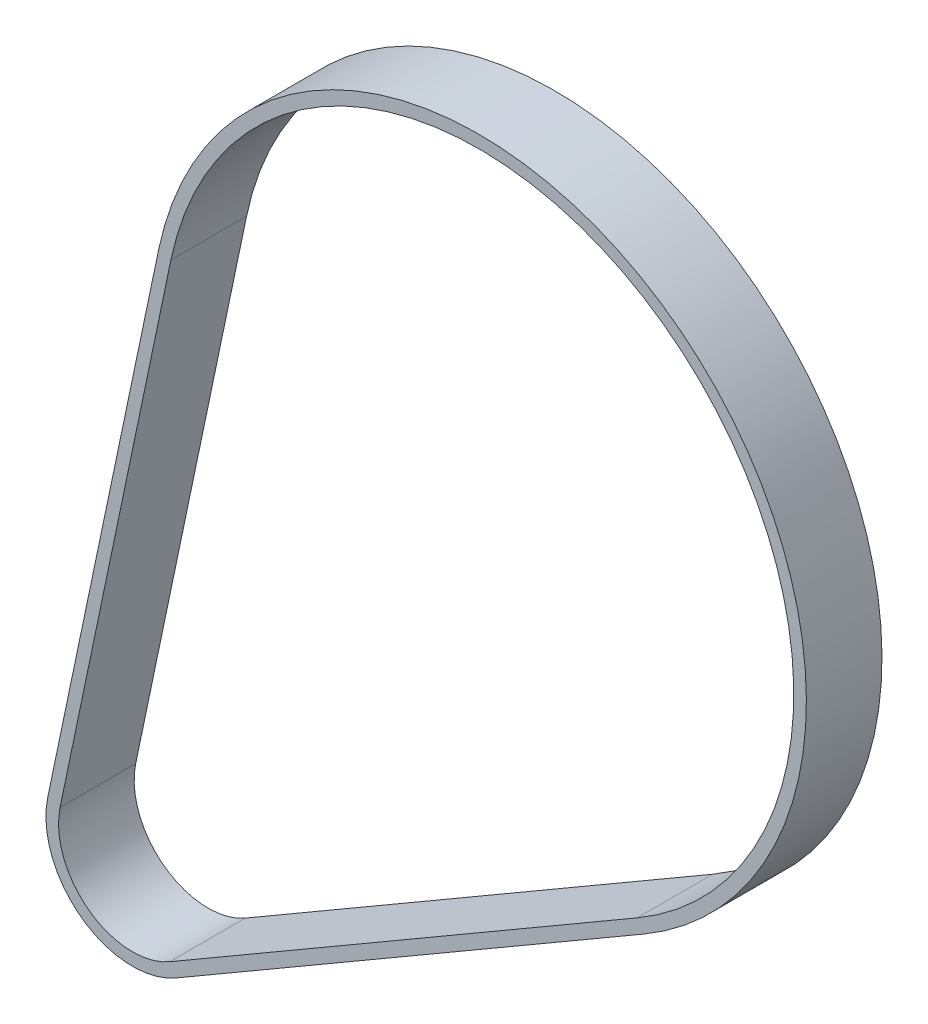
ISO-10303-21;
HEADER;
FILE_DESCRIPTION(('STEP AP214'),'2;1');
FILE_NAME('part.step','',(''),(''),'','','');
FILE_SCHEMA(('AUTOMOTIVE_DESIGN { 1 0 10303 214 1 1 1 1 }'));
ENDSEC;
DATA;
#1=APPLICATION_CONTEXT('core data for automotive mechanical design processes');
#2=APPLICATION_PROTOCOL_DEFINITION('international standard','automotive_design',2000,#1);
#3=PRODUCT_CONTEXT('',#1,'mechanical');
#4=PRODUCT('Part','Part','',(#3));
#5=PRODUCT_RELATED_PRODUCT_CATEGORY('part','',(#4));
#6=PRODUCT_DEFINITION_FORMATION('','',#4);
#7=PRODUCT_DEFINITION_CONTEXT('part definition',#1,'design');
#8=PRODUCT_DEFINITION('design','',#6,#7);
#9=PRODUCT_DEFINITION_SHAPE('','',#8);
#10=(LENGTH_UNIT() NAMED_UNIT(*) SI_UNIT(.MILLI.,.METRE.));
#11=(NAMED_UNIT(*) PLANE_ANGLE_UNIT() SI_UNIT($,.RADIAN.));
#12=(NAMED_UNIT(*) SI_UNIT($,.STERADIAN.) SOLID_ANGLE_UNIT());
#13=UNCERTAINTY_MEASURE_WITH_UNIT(LENGTH_MEASURE(1.E-05),#10,'distance_accuracy_value','');
#14=(GEOMETRIC_REPRESENTATION_CONTEXT(3) GLOBAL_UNCERTAINTY_ASSIGNED_CONTEXT((#13)) GLOBAL_UNIT_ASSIGNED_CONTEXT((#10,
#11,#12)) REPRESENTATION_CONTEXT('',''));
#15=CARTESIAN_POINT('',(0.,0.,0.));
#16=DIRECTION('',(0.,0.,1.));
#17=DIRECTION('',(1.,0.,0.));
#18=AXIS2_PLACEMENT_3D('',#15,#16,#17);
#19=CARTESIAN_POINT('',(-8.,64.4888151747402,-3.));
#20=DIRECTION('',(0.,0.,1.));
#21=DIRECTION('',(1.,0.,0.));
#22=AXIS2_PLACEMENT_3D('',#19,#20,#21);
#23=CYLINDRICAL_SURFACE('',#22,25.9777070063694);
#24=DIRECTION('',(0.,0.,1.));
#25=VECTOR('',#24,1.);
#26=CARTESIAN_POINT('',(-33.4265187349836,69.811728505643,-3.));
#27=LINE('',#26,#25);
#28=CARTESIAN_POINT('',(-33.4265187349836,69.811728505643,-3.));
#29=VERTEX_POINT('',#28);
#30=CARTESIAN_POINT('',(-33.4265187349836,69.811728505643,3.));
#31=VERTEX_POINT('',#30);
#32=EDGE_CURVE('E86',#29,#31,#27,.T.);
#33=ORIENTED_EDGE('',*,*,#32,.T.);
#34=CARTESIAN_POINT('',(-8.,64.4888151747402,3.));
#35=DIRECTION('',(0.,0.,-1.));
#36=DIRECTION('',(-1.,0.,0.));
#37=AXIS2_PLACEMENT_3D('',#34,#35,#36);
#38=CIRCLE('',#37,25.9777070063694);
#39=CARTESIAN_POINT('',(5.05482015074034,42.0296760073411,3.));
#40=VERTEX_POINT('',#39);
#41=EDGE_CURVE('E178',#40,#31,#38,.F.);
#42=ORIENTED_EDGE('',*,*,#41,.F.);
#43=DIRECTION('',(0.,0.,1.));
#44=VECTOR('',#43,1.);
#45=CARTESIAN_POINT('',(5.05482015074034,42.0296760073411,-3.));
#46=LINE('',#45,#44);
#47=CARTESIAN_POINT('',(5.05482015074034,42.0296760073411,-3.));
#48=VERTEX_POINT('',#47);
#49=EDGE_CURVE('E12',#48,#40,#46,.T.);
#50=ORIENTED_EDGE('',*,*,#49,.F.);
#51=CARTESIAN_POINT('',(-8.,64.4888151747402,-3.));
#52=DIRECTION('',(0.,0.,-1.));
#53=DIRECTION('',(-1.,0.,0.));
#54=AXIS2_PLACEMENT_3D('',#51,#52,#53);
#55=CIRCLE('',#54,25.9777070063694);
#56=EDGE_CURVE('E197',#48,#29,#55,.F.);
#57=ORIENTED_EDGE('',*,*,#56,.T.);
#58=EDGE_LOOP('',(#33,#42,#50,#57));
#59=FACE_BOUND('',#58,.T.);
#60=ADVANCED_FACE('F83',(#59),#23,.T.);
#61=CARTESIAN_POINT('',(5.05482015074034,42.0296760073411,-3.));
#62=DIRECTION('',(0.502539356053999,-0.864554333524986,0.));
#63=DIRECTION('',(0.864554333524986,0.502539356053999,0.));
#64=AXIS2_PLACEMENT_3D('',#61,#62,#63);
#65=PLANE('',#64);
#66=ORIENTED_EDGE('',*,*,#49,.T.);
#67=DIRECTION('',(0.864554333524986,0.502539356053999,0.));
#68=VECTOR('',#67,1.);
#69=CARTESIAN_POINT('',(5.05482015074034,42.0296760073411,3.));
#70=LINE('',#69,#68);
#71=CARTESIAN_POINT('',(-32.0430427037947,20.4658073330783,3.));
#72=VERTEX_POINT('',#71);
#73=EDGE_CURVE('E187',#72,#40,#70,.T.);
#74=ORIENTED_EDGE('',*,*,#73,.F.);
#75=DIRECTION('',(0.,0.,1.));
#76=VECTOR('',#75,1.);
#77=CARTESIAN_POINT('',(-32.0430427037947,20.4658073330783,-3.));
#78=LINE('',#77,#76);
#79=CARTESIAN_POINT('',(-32.0430427037947,20.4658073330783,-3.));
#80=VERTEX_POINT('',#79);
#81=EDGE_CURVE('E91',#80,#72,#78,.T.);
#82=ORIENTED_EDGE('',*,*,#81,.F.);
#83=DIRECTION('',(0.864554333524986,0.502539356053999,0.));
#84=VECTOR('',#83,1.);
#85=CARTESIAN_POINT('',(5.05482015074034,42.0296760073411,-3.));
#86=LINE('',#85,#84);
#87=EDGE_CURVE('E208',#80,#48,#86,.T.);
#88=ORIENTED_EDGE('',*,*,#87,.T.);
#89=EDGE_LOOP('',(#66,#74,#82,#88));
#90=FACE_BOUND('',#89,.T.);
#91=ADVANCED_FACE('F220',(#90),#65,.T.);
#92=CARTESIAN_POINT('',(-35.4952,26.4048,-3.));
#93=DIRECTION('',(0.,0.,1.));
#94=DIRECTION('',(1.,0.,0.));
#95=AXIS2_PLACEMENT_3D('',#92,#93,#94);
#96=CYLINDRICAL_SURFACE('',#95,6.86942675159236);
#97=ORIENTED_EDGE('',*,*,#81,.T.);
#98=CARTESIAN_POINT('',(-35.4952,26.4048,3.));
#99=DIRECTION('',(0.,0.,-1.));
#100=DIRECTION('',(-1.,0.,0.));
#101=AXIS2_PLACEMENT_3D('',#98,#99,#100);
#102=CIRCLE('',#101,6.86942675159236);
#103=CARTESIAN_POINT('',(-42.2188730306926,27.8123670043836,3.));
#104=VERTEX_POINT('',#103);
#105=EDGE_CURVE('E184',#104,#72,#102,.F.);
#106=ORIENTED_EDGE('',*,*,#105,.F.);
#107=DIRECTION('',(0.,0.,1.));
#108=VECTOR('',#107,1.);
#109=CARTESIAN_POINT('',(-42.2188730306926,27.8123670043836,-3.));
#110=LINE('',#109,#108);
#111=CARTESIAN_POINT('',(-42.2188730306926,27.8123670043836,-3.));
#112=VERTEX_POINT('',#111);
#113=EDGE_CURVE('E211',#112,#104,#110,.T.);
#114=ORIENTED_EDGE('',*,*,#113,.F.);
#115=CARTESIAN_POINT('',(-35.4952,26.4048,-3.));
#116=DIRECTION('',(0.,0.,-1.));
#117=DIRECTION('',(-1.,0.,0.));
#118=AXIS2_PLACEMENT_3D('',#115,#116,#117);
#119=CIRCLE('',#118,6.86942675159236);
#120=EDGE_CURVE('E205',#112,#80,#119,.F.);
#121=ORIENTED_EDGE('',*,*,#120,.T.);
#122=EDGE_LOOP('',(#97,#106,#114,#121));
#123=FACE_BOUND('',#122,.T.);
#124=ADVANCED_FACE('F226',(#123),#96,.T.);
#125=CARTESIAN_POINT('',(-33.4265187349836,69.811728505643,-3.));
#126=DIRECTION('',(-0.978782258524562,0.204903124421169,0.));
#127=DIRECTION('',(-0.204903124421169,-0.978782258524562,0.));
#128=AXIS2_PLACEMENT_3D('',#125,#126,#127);
#129=PLANE('',#128);
#130=ORIENTED_EDGE('',*,*,#113,.T.);
#131=DIRECTION('',(-0.204903124421169,-0.978782258524562,0.));
#132=VECTOR('',#131,1.);
#133=CARTESIAN_POINT('',(-33.4265187349836,69.811728505643,3.));
#134=LINE('',#133,#132);
#135=EDGE_CURVE('E181',#31,#104,#134,.T.);
#136=ORIENTED_EDGE('',*,*,#135,.F.);
#137=ORIENTED_EDGE('',*,*,#32,.F.);
#138=DIRECTION('',(-0.204903124421169,-0.978782258524562,0.));
#139=VECTOR('',#138,1.);
#140=CARTESIAN_POINT('',(-33.4265187349836,69.811728505643,-3.));
#141=LINE('',#140,#139);
#142=EDGE_CURVE('E202',#29,#112,#141,.T.);
#143=ORIENTED_EDGE('',*,*,#142,.T.);
#144=EDGE_LOOP('',(#130,#136,#137,#143));
#145=FACE_BOUND('',#144,.T.);
#146=ADVANCED_FACE('F215',(#145),#129,.T.);
#147=CARTESIAN_POINT('',(-8.,64.4888151747402,-3.));
#148=DIRECTION('',(0.,0.,-1.));
#149=DIRECTION('',(-1.,0.,0.));
#150=AXIS2_PLACEMENT_3D('',#147,#148,#149);
#151=PLANE('',#150);
#152=CARTESIAN_POINT('',(-8.,64.4888151747402,-3.));
#153=DIRECTION('',(0.,0.,-1.));
#154=DIRECTION('',(-1.,0.,0.));
#155=AXIS2_PLACEMENT_3D('',#152,#153,#154);
#156=CIRCLE('',#155,24.9777070063694);
#157=CARTESIAN_POINT('',(4.55228079468634,42.8942303408661,-3.));
#158=VERTEX_POINT('',#157);
#159=CARTESIAN_POINT('',(-32.447736476459,69.6068253812218,-3.));
#160=VERTEX_POINT('',#159);
#161=EDGE_CURVE('E190',#158,#160,#156,.F.);
#162=ORIENTED_EDGE('',*,*,#161,.T.);
#163=DIRECTION('',(-0.204903124421169,-0.978782258524562,0.));
#164=VECTOR('',#163,1.);
#165=CARTESIAN_POINT('',(-32.4477364764591,69.6068253812218,-3.));
#166=LINE('',#165,#164);
#167=CARTESIAN_POINT('',(-41.2400907721681,27.6074638799624,-3.));
#168=VERTEX_POINT('',#167);
#169=EDGE_CURVE('E155',#160,#168,#166,.T.);
#170=ORIENTED_EDGE('',*,*,#169,.T.);
#171=CARTESIAN_POINT('',(-35.4952,26.4048,-3.));
#172=DIRECTION('',(0.,0.,-1.));
#173=DIRECTION('',(-1.,0.,0.));
#174=AXIS2_PLACEMENT_3D('',#171,#172,#173);
#175=CIRCLE('',#174,5.86942675159236);
#176=CARTESIAN_POINT('',(-32.5455820598487,21.3303616666033,-3.));
#177=VERTEX_POINT('',#176);
#178=EDGE_CURVE('E99',#168,#177,#175,.F.);
#179=ORIENTED_EDGE('',*,*,#178,.T.);
#180=DIRECTION('',(0.864554333524986,0.502539356053999,0.));
#181=VECTOR('',#180,1.);
#182=CARTESIAN_POINT('',(4.55228079468634,42.8942303408661,-3.));
#183=LINE('',#182,#181);
#184=EDGE_CURVE('E160',#177,#158,#183,.T.);
#185=ORIENTED_EDGE('',*,*,#184,.T.);
#186=EDGE_LOOP('',(#162,#170,#179,#185));
#187=FACE_BOUND('',#186,.T.);
#188=ORIENTED_EDGE('',*,*,#56,.F.);
#189=ORIENTED_EDGE('',*,*,#87,.F.);
#190=ORIENTED_EDGE('',*,*,#120,.F.);
#191=ORIENTED_EDGE('',*,*,#142,.F.);
#192=EDGE_LOOP('',(#188,#189,#190,#191));
#193=FACE_BOUND('',#192,.T.);
#194=ADVANCED_FACE('F224',(#187,#193),#151,.T.);
#195=CARTESIAN_POINT('',(-8.,64.4888151747402,-3.));
#196=DIRECTION('',(0.,0.,1.));
#197=DIRECTION('',(1.,0.,0.));
#198=AXIS2_PLACEMENT_3D('',#195,#196,#197);
#199=CYLINDRICAL_SURFACE('',#198,24.9777070063694);
#200=DIRECTION('',(0.,0.,1.));
#201=VECTOR('',#200,1.);
#202=CARTESIAN_POINT('',(4.55228079468634,42.8942303408661,-3.));
#203=LINE('',#202,#201);
#204=CARTESIAN_POINT('',(4.55228079468634,42.8942303408661,3.));
#205=VERTEX_POINT('',#204);
#206=EDGE_CURVE('E165',#158,#205,#203,.T.);
#207=ORIENTED_EDGE('',*,*,#206,.T.);
#208=CARTESIAN_POINT('',(-8.,64.4888151747402,3.));
#209=DIRECTION('',(0.,0.,-1.));
#210=DIRECTION('',(-1.,0.,0.));
#211=AXIS2_PLACEMENT_3D('',#208,#209,#210);
#212=CIRCLE('',#211,24.9777070063694);
#213=CARTESIAN_POINT('',(-32.447736476459,69.6068253812218,3.));
#214=VERTEX_POINT('',#213);
#215=EDGE_CURVE('E163',#205,#214,#212,.F.);
#216=ORIENTED_EDGE('',*,*,#215,.T.);
#217=DIRECTION('',(0.,0.,1.));
#218=VECTOR('',#217,1.);
#219=CARTESIAN_POINT('',(-32.447736476459,69.6068253812218,-3.));
#220=LINE('',#219,#218);
#221=EDGE_CURVE('E148',#160,#214,#220,.T.);
#222=ORIENTED_EDGE('',*,*,#221,.F.);
#223=ORIENTED_EDGE('',*,*,#161,.F.);
#224=EDGE_LOOP('',(#207,#216,#222,#223));
#225=FACE_BOUND('',#224,.T.);
#226=ADVANCED_FACE('F164',(#225),#199,.F.);
#227=CARTESIAN_POINT('',(4.55228079468634,42.8942303408661,-3.));
#228=DIRECTION('',(0.502539356053999,-0.864554333524986,0.));
#229=DIRECTION('',(0.864554333524986,0.502539356053999,0.));
#230=AXIS2_PLACEMENT_3D('',#227,#228,#229);
#231=PLANE('',#230);
#232=DIRECTION('',(0.,0.,1.));
#233=VECTOR('',#232,1.);
#234=CARTESIAN_POINT('',(-32.5455820598487,21.3303616666033,-3.));
#235=LINE('',#234,#233);
#236=CARTESIAN_POINT('',(-32.5455820598487,21.3303616666033,3.));
#237=VERTEX_POINT('',#236);
#238=EDGE_CURVE('E198',#177,#237,#235,.T.);
#239=ORIENTED_EDGE('',*,*,#238,.T.);
#240=DIRECTION('',(0.864554333524986,0.502539356053999,0.));
#241=VECTOR('',#240,1.);
#242=CARTESIAN_POINT('',(4.55228079468634,42.8942303408661,3.));
#243=LINE('',#242,#241);
#244=EDGE_CURVE('E174',#237,#205,#243,.T.);
#245=ORIENTED_EDGE('',*,*,#244,.T.);
#246=ORIENTED_EDGE('',*,*,#206,.F.);
#247=ORIENTED_EDGE('',*,*,#184,.F.);
#248=EDGE_LOOP('',(#239,#245,#246,#247));
#249=FACE_BOUND('',#248,.T.);
#250=ADVANCED_FACE('F269',(#249),#231,.F.);
#251=CARTESIAN_POINT('',(-35.4952,26.4048,-3.));
#252=DIRECTION('',(0.,0.,1.));
#253=DIRECTION('',(1.,0.,0.));
#254=AXIS2_PLACEMENT_3D('',#251,#252,#253);
#255=CYLINDRICAL_SURFACE('',#254,5.86942675159236);
#256=DIRECTION('',(0.,0.,1.));
#257=VECTOR('',#256,1.);
#258=CARTESIAN_POINT('',(-41.2400907721681,27.6074638799624,-3.));
#259=LINE('',#258,#257);
#260=CARTESIAN_POINT('',(-41.2400907721681,27.6074638799624,3.));
#261=VERTEX_POINT('',#260);
#262=EDGE_CURVE('E159',#168,#261,#259,.T.);
#263=ORIENTED_EDGE('',*,*,#262,.T.);
#264=CARTESIAN_POINT('',(-35.4952,26.4048,3.));
#265=DIRECTION('',(0.,0.,-1.));
#266=DIRECTION('',(-1.,0.,0.));
#267=AXIS2_PLACEMENT_3D('',#264,#265,#266);
#268=CIRCLE('',#267,5.86942675159236);
#269=EDGE_CURVE('E172',#261,#237,#268,.F.);
#270=ORIENTED_EDGE('',*,*,#269,.T.);
#271=ORIENTED_EDGE('',*,*,#238,.F.);
#272=ORIENTED_EDGE('',*,*,#178,.F.);
#273=EDGE_LOOP('',(#263,#270,#271,#272));
#274=FACE_BOUND('',#273,.T.);
#275=ADVANCED_FACE('F278',(#274),#255,.F.);
#276=CARTESIAN_POINT('',(-32.4477364764591,69.6068253812218,-3.));
#277=DIRECTION('',(-0.978782258524562,0.204903124421169,0.));
#278=DIRECTION('',(-0.204903124421169,-0.978782258524562,0.));
#279=AXIS2_PLACEMENT_3D('',#276,#277,#278);
#280=PLANE('',#279);
#281=ORIENTED_EDGE('',*,*,#221,.T.);
#282=DIRECTION('',(-0.204903124421169,-0.978782258524562,0.));
#283=VECTOR('',#282,1.);
#284=CARTESIAN_POINT('',(-32.4477364764591,69.6068253812218,3.));
#285=LINE('',#284,#283);
#286=EDGE_CURVE('E152',#214,#261,#285,.T.);
#287=ORIENTED_EDGE('',*,*,#286,.T.);
#288=ORIENTED_EDGE('',*,*,#262,.F.);
#289=ORIENTED_EDGE('',*,*,#169,.F.);
#290=EDGE_LOOP('',(#281,#287,#288,#289));
#291=FACE_BOUND('',#290,.T.);
#292=ADVANCED_FACE('F150',(#291),#280,.F.);
#293=CARTESIAN_POINT('',(-8.,64.4888151747402,3.));
#294=DIRECTION('',(0.,0.,-1.));
#295=DIRECTION('',(-1.,0.,0.));
#296=AXIS2_PLACEMENT_3D('',#293,#294,#295);
#297=PLANE('',#296);
#298=ORIENTED_EDGE('',*,*,#41,.T.);
#299=ORIENTED_EDGE('',*,*,#135,.T.);
#300=ORIENTED_EDGE('',*,*,#105,.T.);
#301=ORIENTED_EDGE('',*,*,#73,.T.);
#302=EDGE_LOOP('',(#298,#299,#300,#301));
#303=FACE_BOUND('',#302,.T.);
#304=ORIENTED_EDGE('',*,*,#215,.F.);
#305=ORIENTED_EDGE('',*,*,#244,.F.);
#306=ORIENTED_EDGE('',*,*,#269,.F.);
#307=ORIENTED_EDGE('',*,*,#286,.F.);
#308=EDGE_LOOP('',(#304,#305,#306,#307));
#309=FACE_BOUND('',#308,.T.);
#310=ADVANCED_FACE('F170',(#303,#309),#297,.F.);
#311=CLOSED_SHELL('',(#60,#91,#124,#146,#194,#226,#250,#275,#292,#310));
#312=MANIFOLD_SOLID_BREP('B2',#311);
#313=ADVANCED_BREP_SHAPE_REPRESENTATION('',(#18,#312),#14);
#314=SHAPE_DEFINITION_REPRESENTATION(#9,#313);
ENDSEC;
END-ISO-10303-21;
